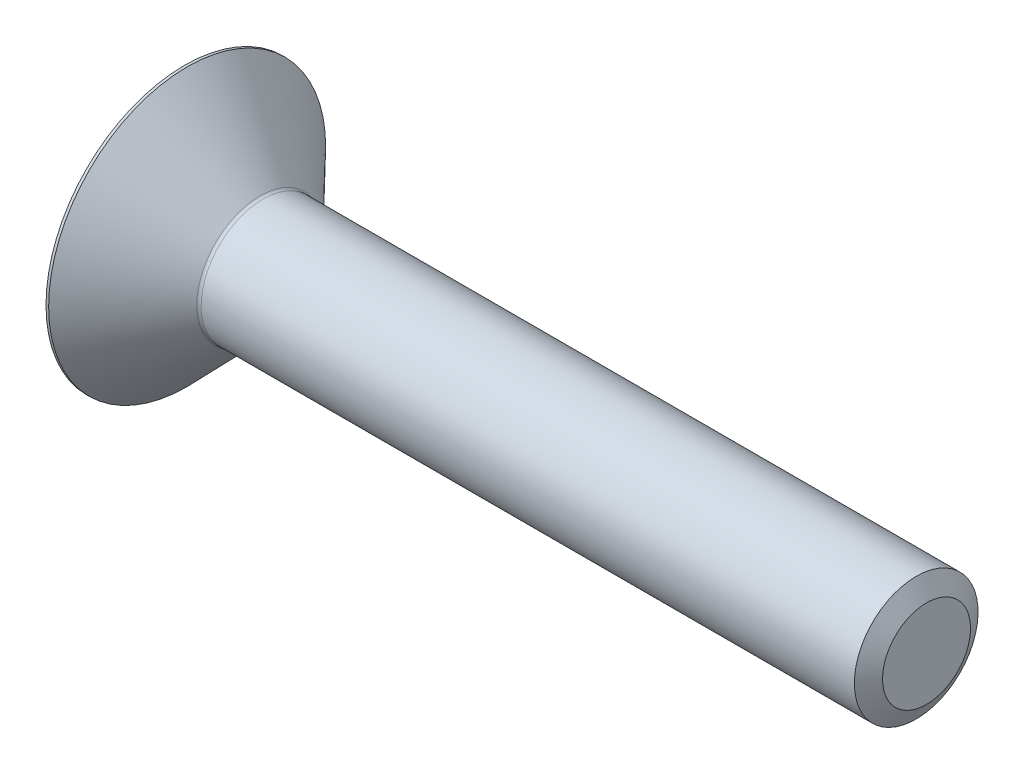
ISO-10303-21;
HEADER;
FILE_DESCRIPTION(('STEP AP214'),'2;1');
FILE_NAME('part.step','',(''),(''),'','','');
FILE_SCHEMA(('AUTOMOTIVE_DESIGN { 1 0 10303 214 1 1 1 1 }'));
ENDSEC;
DATA;
#1=APPLICATION_CONTEXT('core data for automotive mechanical design processes');
#2=APPLICATION_PROTOCOL_DEFINITION('international standard','automotive_design',2000,#1);
#3=PRODUCT_CONTEXT('',#1,'mechanical');
#4=PRODUCT('Part','Part','',(#3));
#5=PRODUCT_RELATED_PRODUCT_CATEGORY('part','',(#4));
#6=PRODUCT_DEFINITION_FORMATION('','',#4);
#7=PRODUCT_DEFINITION_CONTEXT('part definition',#1,'design');
#8=PRODUCT_DEFINITION('design','',#6,#7);
#9=PRODUCT_DEFINITION_SHAPE('','',#8);
#10=(LENGTH_UNIT() NAMED_UNIT(*) SI_UNIT(.MILLI.,.METRE.));
#11=(NAMED_UNIT(*) PLANE_ANGLE_UNIT() SI_UNIT($,.RADIAN.));
#12=(NAMED_UNIT(*) SI_UNIT($,.STERADIAN.) SOLID_ANGLE_UNIT());
#13=UNCERTAINTY_MEASURE_WITH_UNIT(LENGTH_MEASURE(1.E-05),#10,'distance_accuracy_value','');
#14=(GEOMETRIC_REPRESENTATION_CONTEXT(3) GLOBAL_UNCERTAINTY_ASSIGNED_CONTEXT((#13)) GLOBAL_UNIT_ASSIGNED_CONTEXT((#10,
#11,#12)) REPRESENTATION_CONTEXT('',''));
#15=CARTESIAN_POINT('',(0.,0.,0.));
#16=DIRECTION('',(0.,0.,1.));
#17=DIRECTION('',(1.,0.,0.));
#18=AXIS2_PLACEMENT_3D('',#15,#16,#17);
#19=CARTESIAN_POINT('',(-16.9039999999541,0.,0.));
#20=DIRECTION('',(-1.,0.,0.));
#21=DIRECTION('',(0.,0.,1.));
#22=AXIS2_PLACEMENT_3D('',#19,#20,#21);
#23=CONICAL_SURFACE('',#22,1.1616287414995,1.04719755118452);
#24=CARTESIAN_POINT('',(-16.2333333332754,0.,1.13686837721616E-10));
#25=VERTEX_POINT('',#24);
#26=VERTEX_LOOP('',#25);
#27=FACE_BOUND('',#26,.T.);
#28=CARTESIAN_POINT('',(-16.9000000000161,-1.15470053837692,4.0339967123924E-12));
#29=CARTESIAN_POINT('',(-16.8853477725791,-1.12932949060539,0.0439439437855954));
#30=CARTESIAN_POINT('',(-16.8720223385656,-1.10373944031041,0.0882672110647425));
#31=CARTESIAN_POINT('',(-16.8487631937152,-1.05211626511723,0.17768117334735));
#32=CARTESIAN_POINT('',(-16.8388377101839,-1.0260822232737,0.22277345654672));
#33=CARTESIAN_POINT('',(-16.8233879794877,-0.974336766416638,0.312399216884018));
#34=CARTESIAN_POINT('',(-16.8177608938131,-0.948633310874631,0.356918907812861));
#35=CARTESIAN_POINT('',(-16.81104458408,-0.897105519638419,0.446167660235783));
#36=CARTESIAN_POINT('',(-16.809949797002,-0.871281371105214,0.490896397557499));
#37=CARTESIAN_POINT('',(-16.8122331450927,-0.823031719919259,0.574467244859048));
#38=CARTESIAN_POINT('',(-16.8150506426236,-0.800598977013268,0.613321895325356));
#39=CARTESIAN_POINT('',(-16.8239786503747,-0.755879633203904,0.690778070884315));
#40=CARTESIAN_POINT('',(-16.8300922074001,-0.733593186857356,0.729379328276695));
#41=CARTESIAN_POINT('',(-16.8453749166851,-0.688781716982386,0.806995070861984));
#42=CARTESIAN_POINT('',(-16.8546088211251,-0.66626236208915,0.845999737690744));
#43=CARTESIAN_POINT('',(-16.8755658804358,-0.621559431337452,0.923427484999919));
#44=CARTESIAN_POINT('',(-16.8872841143922,-0.599375283224557,0.961851556654085));
#45=CARTESIAN_POINT('',(-16.9000000000161,-0.577350269191957,0.999999999995966));
#46=B_SPLINE_CURVE_WITH_KNOTS('',3,(#28,#29,#30,#31,#32,#33,#34,#35,#36,#37,#38,#39,#40,#41,#42,
#43,#44,#45),.UNSPECIFIED.,.F.,.F.,(4,2,2,2,2,2,2,2,4),(0.,0.158508005778845,0.317396908514408,
0.472353803077548,0.627120444450221,0.761853891314731,0.89671209689346,1.0345608112381,
1.17213898674875),.UNSPECIFIED.);
#47=CARTESIAN_POINT('',(-16.9000000000161,-1.15470053837692,0.));
#48=VERTEX_POINT('',#47);
#49=CARTESIAN_POINT('',(-16.9000000000168,-0.577350269190795,0.999999999997983));
#50=VERTEX_POINT('',#49);
#51=EDGE_CURVE('E20',#48,#50,#46,.T.);
#52=ORIENTED_EDGE('',*,*,#51,.T.);
#53=CARTESIAN_POINT('',(-16.9000000000161,-0.57735026918497,1.));
#54=CARTESIAN_POINT('',(-16.8863168864524,-0.529955537080034,0.999999999999876));
#55=CARTESIAN_POINT('',(-16.873789609974,-0.482185870569069,0.999999999999938));
#56=CARTESIAN_POINT('',(-16.8516492031741,-0.385870552392807,1.00000000000006));
#57=CARTESIAN_POINT('',(-16.8420425930767,-0.337323415542599,1.00000000000012));
#58=CARTESIAN_POINT('',(-16.8265940010239,-0.240773884149867,0.999999999999879));
#59=CARTESIAN_POINT('',(-16.8206696536425,-0.192785083011085,0.99999999999958));
#60=CARTESIAN_POINT('',(-16.8127165686723,-0.0965306160788095,1.00000000000042));
#61=CARTESIAN_POINT('',(-16.810683602537,-0.0482653080392742,1.00000000000156));
#62=CARTESIAN_POINT('',(-16.8106836025371,0.0482653080397529,1.00000000000156));
#63=CARTESIAN_POINT('',(-16.8127165686723,0.0965306160792449,1.00000000000042));
#64=CARTESIAN_POINT('',(-16.8206696536426,0.192785083011433,0.99999999999958));
#65=CARTESIAN_POINT('',(-16.8265940010239,0.240773884150171,0.999999999999879));
#66=CARTESIAN_POINT('',(-16.8420425930768,0.337323415542815,1.00000000000012));
#67=CARTESIAN_POINT('',(-16.8516492031742,0.385870552392978,1.00000000000006));
#68=CARTESIAN_POINT('',(-16.873789609974,0.482185870569151,0.999999999999938));
#69=CARTESIAN_POINT('',(-16.8863168864524,0.529955537080074,0.999999999999876));
#70=CARTESIAN_POINT('',(-16.9000000000161,0.577350269184966,1.));
#71=B_SPLINE_CURVE_WITH_KNOTS('',3,(#53,#54,#55,#56,#57,#58,#59,#60,#61,#62,#63,#64,#65,#66,#67,
#68,#69,#70),.UNSPECIFIED.,.F.,.F.,(4,2,2,2,2,2,2,2,4),(0.,0.148036697957628,0.296401493042135,
0.441315429581836,0.586071806658116,0.730828183734268,0.875742120273841,1.02410691535821,
1.17214361331571),.UNSPECIFIED.);
#72=CARTESIAN_POINT('',(-16.9000000000161,0.57735026918846,0.999999999997983));
#73=VERTEX_POINT('',#72);
#74=EDGE_CURVE('E81',#50,#73,#71,.T.);
#75=ORIENTED_EDGE('',*,*,#74,.T.);
#76=CARTESIAN_POINT('',(-16.9000000000161,0.577350269191953,0.999999999995966));
#77=CARTESIAN_POINT('',(-16.8853477725791,0.602721316963491,0.956056056214405));
#78=CARTESIAN_POINT('',(-16.8720223385656,0.62831136725847,0.911732788935258));
#79=CARTESIAN_POINT('',(-16.8487631937152,0.679934542451645,0.82231882665265));
#80=CARTESIAN_POINT('',(-16.8388377101839,0.705968584295175,0.777226543453281));
#81=CARTESIAN_POINT('',(-16.8233879794877,0.757714041152239,0.687600783115984));
#82=CARTESIAN_POINT('',(-16.8177608938131,0.783417496694246,0.64308109218714));
#83=CARTESIAN_POINT('',(-16.81104458408,0.834945287930458,0.553832339764219));
#84=CARTESIAN_POINT('',(-16.809949797002,0.860769436463662,0.509103602442503));
#85=CARTESIAN_POINT('',(-16.8122331450927,0.909019087649617,0.425532755140954));
#86=CARTESIAN_POINT('',(-16.8150506426236,0.931451830555608,0.386678104674646));
#87=CARTESIAN_POINT('',(-16.8239786503747,0.976171174364972,0.309221929115687));
#88=CARTESIAN_POINT('',(-16.8300922074001,0.998457620711521,0.270620671723307));
#89=CARTESIAN_POINT('',(-16.8453749166851,1.04326909058649,0.193004929138017));
#90=CARTESIAN_POINT('',(-16.8546088211251,1.06578844547973,0.154000262309257));
#91=CARTESIAN_POINT('',(-16.8755658804358,1.11049137623143,0.0765725150000815));
#92=CARTESIAN_POINT('',(-16.8872841143922,1.13267552434432,0.0381484433459156));
#93=CARTESIAN_POINT('',(-16.9000000000161,1.15470053837692,4.03385526722819E-12));
#94=B_SPLINE_CURVE_WITH_KNOTS('',3,(#76,#77,#78,#79,#80,#81,#82,#83,#84,#85,#86,#87,#88,#89,#90,
#91,#92,#93),.UNSPECIFIED.,.F.,.F.,(4,2,2,2,2,2,2,2,4),(0.,0.158508005778844,0.317396908514406,
0.472353803077547,0.627120444450219,0.761853891314729,0.896712096893458,1.0345608112381,
1.17213898674875),.UNSPECIFIED.);
#95=CARTESIAN_POINT('',(-16.9000000000161,1.15470053837692,0.));
#96=VERTEX_POINT('',#95);
#97=EDGE_CURVE('E93',#73,#96,#94,.T.);
#98=ORIENTED_EDGE('',*,*,#97,.T.);
#99=CARTESIAN_POINT('',(-16.9000000000161,1.15470053837692,-4.03331058430735E-12));
#100=CARTESIAN_POINT('',(-16.8853477725791,1.12932949060538,-0.0439439437855945));
#101=CARTESIAN_POINT('',(-16.8720223385656,1.1037394403104,-0.0882672110647415));
#102=CARTESIAN_POINT('',(-16.8487631937152,1.05211626511723,-0.177681173347349));
#103=CARTESIAN_POINT('',(-16.8388377101839,1.0260822232737,-0.222773456546718));
#104=CARTESIAN_POINT('',(-16.8233879794877,0.974336766416635,-0.312399216884015));
#105=CARTESIAN_POINT('',(-16.8177608938131,0.948633310874628,-0.356918907812859));
#106=CARTESIAN_POINT('',(-16.81104458408,0.897105519638416,-0.446167660235781));
#107=CARTESIAN_POINT('',(-16.809949797002,0.871281371105211,-0.490896397557496));
#108=CARTESIAN_POINT('',(-16.8122331450927,0.823031719919257,-0.574467244859045));
#109=CARTESIAN_POINT('',(-16.8150506426236,0.800598977013266,-0.613321895325353));
#110=CARTESIAN_POINT('',(-16.8239786503747,0.755879633203902,-0.690778070884312));
#111=CARTESIAN_POINT('',(-16.8300922074001,0.733593186857353,-0.729379328276692));
#112=CARTESIAN_POINT('',(-16.8453749166851,0.688781716982383,-0.806995070861982));
#113=CARTESIAN_POINT('',(-16.8546088211251,0.666262362089147,-0.845999737690742));
#114=CARTESIAN_POINT('',(-16.8755658804358,0.621559431337448,-0.923427484999917));
#115=CARTESIAN_POINT('',(-16.8872841143922,0.599375283224554,-0.961851556654083));
#116=CARTESIAN_POINT('',(-16.9000000000161,0.577350269191954,-0.999999999995965));
#117=B_SPLINE_CURVE_WITH_KNOTS('',3,(#99,#100,#101,#102,#103,#104,#105,#106,#107,#108,#109,#110,
#111,#112,#113,#114,#115,#116),.UNSPECIFIED.,.F.,.F.,(4,2,2,2,2,2,2,2,4),(0.,0.158508005778844,
0.317396908514406,0.472353803077546,0.627120444450219,0.761853891314728,0.896712096893457,
1.03456081123809,1.17213898674875),.UNSPECIFIED.);
#118=CARTESIAN_POINT('',(-16.9000000000161,0.577350269188461,-0.999999999997983));
#119=VERTEX_POINT('',#118);
#120=EDGE_CURVE('E100',#96,#119,#117,.T.);
#121=ORIENTED_EDGE('',*,*,#120,.T.);
#122=CARTESIAN_POINT('',(-16.9000000000161,0.577350269184967,-1.));
#123=CARTESIAN_POINT('',(-16.8863168864524,0.529955537080106,-0.999999999999876));
#124=CARTESIAN_POINT('',(-16.873789609974,0.482185870569216,-0.999999999999938));
#125=CARTESIAN_POINT('',(-16.8516492031742,0.385870552393109,-1.00000000000006));
#126=CARTESIAN_POINT('',(-16.8420425930768,0.337323415542979,-1.00000000000012));
#127=CARTESIAN_POINT('',(-16.8265940010239,0.240773884150401,-0.999999999999879));
#128=CARTESIAN_POINT('',(-16.8206696536426,0.192785083011696,-0.99999999999958));
#129=CARTESIAN_POINT('',(-16.8127165686724,0.096530616079572,-1.00000000000042));
#130=CARTESIAN_POINT('',(-16.8106836025371,0.0482653080401124,-1.00000000000156));
#131=CARTESIAN_POINT('',(-16.810683602537,-0.0482653080389148,-1.00000000000156));
#132=CARTESIAN_POINT('',(-16.8127165686723,-0.0965306160784825,-1.00000000000042));
#133=CARTESIAN_POINT('',(-16.8206696536425,-0.192785083010823,-0.99999999999958));
#134=CARTESIAN_POINT('',(-16.8265940010238,-0.240773884149637,-0.999999999999879));
#135=CARTESIAN_POINT('',(-16.8420425930767,-0.337323415542435,-1.00000000000012));
#136=CARTESIAN_POINT('',(-16.8516492031741,-0.385870552392677,-1.00000000000006));
#137=CARTESIAN_POINT('',(-16.8737896099739,-0.482185870569004,-0.999999999999938));
#138=CARTESIAN_POINT('',(-16.8863168864524,-0.529955537080002,-0.999999999999876));
#139=CARTESIAN_POINT('',(-16.9000000000161,-0.577350269184969,-1.));
#140=B_SPLINE_CURVE_WITH_KNOTS('',3,(#122,#123,#124,#125,#126,#127,#128,#129,#130,#131,#132,
#133,#134,#135,#136,#137,#138,#139),.UNSPECIFIED.,.F.,.F.,(4,2,2,2,2,2,2,2,4),(0.,
0.148036697957395,0.296401493041668,0.441315429581145,0.586071806657201,0.730828183733577,
0.875742120273374,1.02410691535798,1.17214361331571),.UNSPECIFIED.);
#141=CARTESIAN_POINT('',(-16.9000000000161,-0.577350269188463,-0.999999999997983));
#142=VERTEX_POINT('',#141);
#143=EDGE_CURVE('E103',#119,#142,#140,.T.);
#144=ORIENTED_EDGE('',*,*,#143,.T.);
#145=CARTESIAN_POINT('',(-16.9000000000161,-0.577350269191957,-0.999999999995966));
#146=CARTESIAN_POINT('',(-16.8853477725791,-0.602721316963495,-0.956056056214404));
#147=CARTESIAN_POINT('',(-16.8720223385656,-0.628311367258474,-0.911732788935257));
#148=CARTESIAN_POINT('',(-16.8487631937152,-0.679934542451649,-0.82231882665265));
#149=CARTESIAN_POINT('',(-16.8388377101839,-0.70596858429518,-0.777226543453281));
#150=CARTESIAN_POINT('',(-16.8233879794877,-0.757714041152243,-0.687600783115983));
#151=CARTESIAN_POINT('',(-16.8177608938131,-0.78341749669425,-0.64308109218714));
#152=CARTESIAN_POINT('',(-16.81104458408,-0.834945287930462,-0.553832339764218));
#153=CARTESIAN_POINT('',(-16.809949797002,-0.860769436463667,-0.509103602442502));
#154=CARTESIAN_POINT('',(-16.8122331450927,-0.909019087649621,-0.425532755140953));
#155=CARTESIAN_POINT('',(-16.8150506426236,-0.931451830555613,-0.386678104674645));
#156=CARTESIAN_POINT('',(-16.8239786503747,-0.976171174364977,-0.309221929115686));
#157=CARTESIAN_POINT('',(-16.8300922074001,-0.998457620711525,-0.270620671723307));
#158=CARTESIAN_POINT('',(-16.8453749166851,-1.0432690905865,-0.193004929138016));
#159=CARTESIAN_POINT('',(-16.8546088211251,-1.06578844547973,-0.154000262309256));
#160=CARTESIAN_POINT('',(-16.8755658804358,-1.11049137623143,-0.0765725150000809));
#161=CARTESIAN_POINT('',(-16.8872841143922,-1.13267552434432,-0.0381484433459151));
#162=CARTESIAN_POINT('',(-16.9000000000161,-1.15470053837692,-4.0342541360767E-12));
#163=B_SPLINE_CURVE_WITH_KNOTS('',3,(#145,#146,#147,#148,#149,#150,#151,#152,#153,#154,#155,
#156,#157,#158,#159,#160,#161,#162),.UNSPECIFIED.,.F.,.F.,(4,2,2,2,2,2,2,2,4),(0.,
0.158508005778843,0.317396908514406,0.472353803077546,0.627120444450219,0.761853891314729,
0.896712096893458,1.03456081123809,1.17213898674875),.UNSPECIFIED.);
#164=EDGE_CURVE('E73',#142,#48,#163,.T.);
#165=ORIENTED_EDGE('',*,*,#164,.T.);
#166=EDGE_LOOP('',(#52,#75,#98,#121,#144,#165));
#167=FACE_BOUND('',#166,.T.);
#168=ADVANCED_FACE('F16',(#27,#167),#23,.F.);
#169=CARTESIAN_POINT('',(-16.04,-1.15470053837925,0.));
#170=DIRECTION('',(0.,-0.866025403784439,0.5));
#171=DIRECTION('',(0.,-0.5,-0.866025403784439));
#172=AXIS2_PLACEMENT_3D('',#169,#170,#171);
#173=PLANE('',#172);
#174=DIRECTION('',(1.,0.,0.));
#175=VECTOR('',#174,1.);
#176=CARTESIAN_POINT('',(-16.04,-0.577350269189633,1.));
#177=LINE('',#176,#175);
#178=CARTESIAN_POINT('',(-17.9999999999999,-0.577350269189771,1.00000000000002));
#179=VERTEX_POINT('',#178);
#180=EDGE_CURVE('E85',#179,#50,#177,.T.);
#181=ORIENTED_EDGE('',*,*,#180,.T.);
#182=ORIENTED_EDGE('',*,*,#51,.F.);
#183=DIRECTION('',(1.,0.,0.));
#184=VECTOR('',#183,1.);
#185=CARTESIAN_POINT('',(-16.04,-1.15470053837925,0.));
#186=LINE('',#185,#184);
#187=CARTESIAN_POINT('',(-17.9999999999999,-1.15470053837933,0.));
#188=VERTEX_POINT('',#187);
#189=EDGE_CURVE('E104',#48,#188,#186,.F.);
#190=ORIENTED_EDGE('',*,*,#189,.T.);
#191=CARTESIAN_POINT('',(-17.9999999999999,-1.15470053837928,0.));
#192=CARTESIAN_POINT('',(-17.9931485433512,-1.1307355483116,0.0415085804000621));
#193=CARTESIAN_POINT('',(-17.9869265071695,-1.106721247571,0.0831025693910098));
#194=CARTESIAN_POINT('',(-17.9759925259882,-1.05859621230057,0.166457575595438));
#195=CARTESIAN_POINT('',(-17.9712812836437,-1.03448543816468,0.208218661408625));
#196=CARTESIAN_POINT('',(-17.9636494177607,-0.986333519050269,0.291620231796733));
#197=CARTESIAN_POINT('',(-17.9607184564333,-0.962292794802696,0.333259987644283));
#198=CARTESIAN_POINT('',(-17.9567881534659,-0.914176509020636,0.416599839290315));
#199=CARTESIAN_POINT('',(-17.9557883832487,-0.890100956402539,0.458299919645156));
#200=CARTESIAN_POINT('',(-17.9557883832487,-0.841949851166346,0.541700080354839));
#201=CARTESIAN_POINT('',(-17.9567881534659,-0.817874298548249,0.58340016070968));
#202=CARTESIAN_POINT('',(-17.9607184564333,-0.769758012766189,0.666740012355712));
#203=CARTESIAN_POINT('',(-17.9636494177607,-0.745717288518616,0.708379768203262));
#204=CARTESIAN_POINT('',(-17.9712812836437,-0.697565369404204,0.79178133859137));
#205=CARTESIAN_POINT('',(-17.9759925259882,-0.673454595268309,0.833542424404557));
#206=CARTESIAN_POINT('',(-17.9869265071695,-0.62532955999788,0.916897430608986));
#207=CARTESIAN_POINT('',(-17.9931485433512,-0.601315259257286,0.958491419599933));
#208=CARTESIAN_POINT('',(-17.9999999999999,-0.577350269189609,1.00000000000003));
#209=B_SPLINE_CURVE_WITH_KNOTS('',3,(#191,#192,#193,#194,#195,#196,#197,#198,#199,#200,#201,
#202,#203,#204,#205,#206,#207,#208),.UNSPECIFIED.,.F.,.F.,(4,2,2,2,2,2,2,2,4),(0.,
0.145260358344985,0.290588178163771,0.435063828864236,0.579507413305438,0.72395099774664,
0.868426648447105,1.01375446826589,1.15901482661088),.UNSPECIFIED.);
#210=EDGE_CURVE('E87',#188,#179,#209,.T.);
#211=ORIENTED_EDGE('',*,*,#210,.T.);
#212=EDGE_LOOP('',(#181,#182,#190,#211));
#213=FACE_BOUND('',#212,.T.);
#214=ADVANCED_FACE('F78',(#213),#173,.F.);
#215=CARTESIAN_POINT('',(-16.04,-0.577350269189628,-1.));
#216=DIRECTION('',(0.,-0.866025403784439,-0.5));
#217=DIRECTION('',(0.,0.5,-0.866025403784439));
#218=AXIS2_PLACEMENT_3D('',#215,#216,#217);
#219=PLANE('',#218);
#220=ORIENTED_EDGE('',*,*,#189,.F.);
#221=ORIENTED_EDGE('',*,*,#164,.F.);
#222=DIRECTION('',(-1.,0.,0.));
#223=VECTOR('',#222,1.);
#224=CARTESIAN_POINT('',(-16.04,-0.577350269189628,-1.));
#225=LINE('',#224,#223);
#226=CARTESIAN_POINT('',(-17.9999999999999,-0.577350269189669,-1.00000000000006));
#227=VERTEX_POINT('',#226);
#228=EDGE_CURVE('E101',#142,#227,#225,.T.);
#229=ORIENTED_EDGE('',*,*,#228,.T.);
#230=CARTESIAN_POINT('',(-17.9999999999999,-0.577350269189609,-1.00000000000003));
#231=CARTESIAN_POINT('',(-17.9931485433512,-0.601315259257285,-0.958491419599933));
#232=CARTESIAN_POINT('',(-17.9869265071695,-0.625329559997879,-0.916897430608986));
#233=CARTESIAN_POINT('',(-17.9759925259882,-0.673454595268309,-0.833542424404558));
#234=CARTESIAN_POINT('',(-17.9712812836437,-0.697565369404204,-0.791781338591371));
#235=CARTESIAN_POINT('',(-17.9636494177607,-0.745717288518615,-0.708379768203263));
#236=CARTESIAN_POINT('',(-17.9607184564333,-0.769758012766189,-0.666740012355713));
#237=CARTESIAN_POINT('',(-17.9567881534659,-0.817874298548249,-0.583400160709681));
#238=CARTESIAN_POINT('',(-17.9557883832487,-0.841949851166345,-0.54170008035484));
#239=CARTESIAN_POINT('',(-17.9557883832487,-0.890100956402539,-0.458299919645157));
#240=CARTESIAN_POINT('',(-17.9567881534659,-0.914176509020636,-0.416599839290315));
#241=CARTESIAN_POINT('',(-17.9607184564333,-0.962292794802696,-0.333259987644283));
#242=CARTESIAN_POINT('',(-17.9636494177607,-0.986333519050269,-0.291620231796734));
#243=CARTESIAN_POINT('',(-17.9712812836437,-1.03448543816468,-0.208218661408626));
#244=CARTESIAN_POINT('',(-17.9759925259882,-1.05859621230057,-0.166457575595439));
#245=CARTESIAN_POINT('',(-17.9869265071695,-1.106721247571,-0.0831025693910105));
#246=CARTESIAN_POINT('',(-17.9931485433512,-1.1307355483116,-0.0415085804000627));
#247=CARTESIAN_POINT('',(-17.9999999999999,-1.15470053837928,0.));
#248=B_SPLINE_CURVE_WITH_KNOTS('',3,(#230,#231,#232,#233,#234,#235,#236,#237,#238,#239,#240,
#241,#242,#243,#244,#245,#246,#247),.UNSPECIFIED.,.F.,.F.,(4,2,2,2,2,2,2,2,4),(0.,
0.145260358344985,0.290588178163772,0.435063828864236,0.579507413305438,0.723950997746641,
0.868426648447105,1.01375446826589,1.15901482661088),.UNSPECIFIED.);
#249=EDGE_CURVE('E213',#227,#188,#248,.T.);
#250=ORIENTED_EDGE('',*,*,#249,.T.);
#251=EDGE_LOOP('',(#220,#221,#229,#250));
#252=FACE_BOUND('',#251,.T.);
#253=ADVANCED_FACE('F207',(#252),#219,.F.);
#254=CARTESIAN_POINT('',(-16.04,0.577350269189624,-1.));
#255=DIRECTION('',(0.,0.,-1.));
#256=DIRECTION('',(-1.,0.,0.));
#257=AXIS2_PLACEMENT_3D('',#254,#255,#256);
#258=PLANE('',#257);
#259=ORIENTED_EDGE('',*,*,#228,.F.);
#260=ORIENTED_EDGE('',*,*,#143,.F.);
#261=DIRECTION('',(1.,0.,0.));
#262=VECTOR('',#261,1.);
#263=CARTESIAN_POINT('',(-16.04,0.577350269189625,-0.999999999999998));
#264=LINE('',#263,#262);
#265=CARTESIAN_POINT('',(-17.9999999999999,0.577350269189663,-1.00000000000007));
#266=VERTEX_POINT('',#265);
#267=EDGE_CURVE('E98',#119,#266,#264,.F.);
#268=ORIENTED_EDGE('',*,*,#267,.T.);
#269=CARTESIAN_POINT('',(-17.9999999999999,0.577350269189668,-1.));
#270=CARTESIAN_POINT('',(-17.9931485433512,0.529420289054314,-1.));
#271=CARTESIAN_POINT('',(-17.9869265071695,0.481391687573126,-1.));
#272=CARTESIAN_POINT('',(-17.9759925259882,0.385141617032266,-1.));
#273=CARTESIAN_POINT('',(-17.9712812836437,0.336920068760476,-1.));
#274=CARTESIAN_POINT('',(-17.9636494177607,0.240616230531651,-1.));
#275=CARTESIAN_POINT('',(-17.9607184564333,0.192534782036505,-1.));
#276=CARTESIAN_POINT('',(-17.9567881534659,0.0963022104723835,-1.));
#277=CARTESIAN_POINT('',(-17.9557883832487,0.0481511052361896,-1.));
#278=CARTESIAN_POINT('',(-17.9557883832487,-0.0481511052361983,-1.));
#279=CARTESIAN_POINT('',(-17.9567881534659,-0.0963022104723922,-1.));
#280=CARTESIAN_POINT('',(-17.9607184564333,-0.192534782036513,-1.));
#281=CARTESIAN_POINT('',(-17.9636494177607,-0.24061623053166,-1.));
#282=CARTESIAN_POINT('',(-17.9712812836437,-0.336920068760484,-1.));
#283=CARTESIAN_POINT('',(-17.9759925259882,-0.385141617032274,-1.));
#284=CARTESIAN_POINT('',(-17.9869265071695,-0.481391687573134,-1.));
#285=CARTESIAN_POINT('',(-17.9931485433512,-0.529420289054323,-1.));
#286=CARTESIAN_POINT('',(-17.9999999999999,-0.577350269189676,-1.));
#287=B_SPLINE_CURVE_WITH_KNOTS('',3,(#269,#270,#271,#272,#273,#274,#275,#276,#277,#278,#279,
#280,#281,#282,#283,#284,#285,#286),.UNSPECIFIED.,.F.,.F.,(4,2,2,2,2,2,2,2,4),(0.,
0.145260358344988,0.290588178163777,0.435063828864243,0.579507413305447,0.723950997746651,
0.868426648447117,1.01375446826591,1.15901482661089),.UNSPECIFIED.);
#288=EDGE_CURVE('E175',#266,#227,#287,.T.);
#289=ORIENTED_EDGE('',*,*,#288,.T.);
#290=EDGE_LOOP('',(#259,#260,#268,#289));
#291=FACE_BOUND('',#290,.T.);
#292=ADVANCED_FACE('F185',(#291),#258,.F.);
#293=CARTESIAN_POINT('',(-16.04,1.15470053837925,0.));
#294=DIRECTION('',(0.,0.866025403784439,-0.5));
#295=DIRECTION('',(0.,0.5,0.866025403784439));
#296=AXIS2_PLACEMENT_3D('',#293,#294,#295);
#297=PLANE('',#296);
#298=ORIENTED_EDGE('',*,*,#267,.F.);
#299=ORIENTED_EDGE('',*,*,#120,.F.);
#300=DIRECTION('',(1.,0.,0.));
#301=VECTOR('',#300,1.);
#302=CARTESIAN_POINT('',(-16.04,1.15470053837925,0.));
#303=LINE('',#302,#301);
#304=CARTESIAN_POINT('',(-17.9999999999999,1.15470053837933,0.));
#305=VERTEX_POINT('',#304);
#306=EDGE_CURVE('E89',#96,#305,#303,.F.);
#307=ORIENTED_EDGE('',*,*,#306,.T.);
#308=CARTESIAN_POINT('',(-17.9999999999999,1.15470053837927,0.));
#309=CARTESIAN_POINT('',(-17.9931485433512,1.13073554831159,-0.0415085804000635));
#310=CARTESIAN_POINT('',(-17.9869265071695,1.106721247571,-0.0831025693910112));
#311=CARTESIAN_POINT('',(-17.9759925259882,1.05859621230057,-0.16645757559544));
#312=CARTESIAN_POINT('',(-17.9712812836437,1.03448543816467,-0.208218661408627));
#313=CARTESIAN_POINT('',(-17.9636494177607,0.986333519050263,-0.291620231796735));
#314=CARTESIAN_POINT('',(-17.9607184564333,0.96229279480269,-0.333259987644286));
#315=CARTESIAN_POINT('',(-17.9567881534659,0.91417650902063,-0.416599839290318));
#316=CARTESIAN_POINT('',(-17.9557883832487,0.890100956402533,-0.45829991964516));
#317=CARTESIAN_POINT('',(-17.9557883832487,0.841949851166339,-0.541700080354843));
#318=CARTESIAN_POINT('',(-17.9567881534659,0.817874298548242,-0.583400160709684));
#319=CARTESIAN_POINT('',(-17.9607184564333,0.769758012766182,-0.666740012355717));
#320=CARTESIAN_POINT('',(-17.9636494177607,0.745717288518609,-0.708379768203267));
#321=CARTESIAN_POINT('',(-17.9712812836437,0.697565369404197,-0.791781338591375));
#322=CARTESIAN_POINT('',(-17.9759925259882,0.673454595268302,-0.833542424404562));
#323=CARTESIAN_POINT('',(-17.9869265071695,0.625329559997873,-0.916897430608991));
#324=CARTESIAN_POINT('',(-17.9931485433512,0.601315259257279,-0.958491419599939));
#325=CARTESIAN_POINT('',(-17.9999999999999,0.577350269189602,-1.00000000000004));
#326=B_SPLINE_CURVE_WITH_KNOTS('',3,(#308,#309,#310,#311,#312,#313,#314,#315,#316,#317,#318,
#319,#320,#321,#322,#323,#324,#325),.UNSPECIFIED.,.F.,.F.,(4,2,2,2,2,2,2,2,4),(0.,
0.145260358344986,0.290588178163773,0.435063828864238,0.579507413305441,0.723950997746644,
0.868426648447109,1.0137544682659,1.15901482661088),.UNSPECIFIED.);
#327=EDGE_CURVE('E168',#305,#266,#326,.T.);
#328=ORIENTED_EDGE('',*,*,#327,.T.);
#329=EDGE_LOOP('',(#298,#299,#307,#328));
#330=FACE_BOUND('',#329,.T.);
#331=ADVANCED_FACE('F181',(#330),#297,.F.);
#332=CARTESIAN_POINT('',(-16.04,0.577350269189624,1.));
#333=DIRECTION('',(0.,0.866025403784439,0.5));
#334=DIRECTION('',(0.,-0.5,0.866025403784439));
#335=AXIS2_PLACEMENT_3D('',#332,#333,#334);
#336=PLANE('',#335);
#337=ORIENTED_EDGE('',*,*,#306,.F.);
#338=ORIENTED_EDGE('',*,*,#97,.F.);
#339=DIRECTION('',(1.,0.,0.));
#340=VECTOR('',#339,1.);
#341=CARTESIAN_POINT('',(-16.04,0.577350269189624,1.));
#342=LINE('',#341,#340);
#343=CARTESIAN_POINT('',(-17.9999999999999,0.577350269189664,1.00000000000007));
#344=VERTEX_POINT('',#343);
#345=EDGE_CURVE('E91',#73,#344,#342,.F.);
#346=ORIENTED_EDGE('',*,*,#345,.T.);
#347=CARTESIAN_POINT('',(-17.9999999999999,0.577350269189603,1.00000000000004));
#348=CARTESIAN_POINT('',(-17.9931485433512,0.60131525925728,0.958491419599935));
#349=CARTESIAN_POINT('',(-17.9869265071695,0.625329559997874,0.916897430608987));
#350=CARTESIAN_POINT('',(-17.9759925259882,0.673454595268304,0.833542424404559));
#351=CARTESIAN_POINT('',(-17.9712812836437,0.697565369404199,0.791781338591371));
#352=CARTESIAN_POINT('',(-17.9636494177607,0.745717288518611,0.708379768203263));
#353=CARTESIAN_POINT('',(-17.9607184564333,0.769758012766184,0.666740012355713));
#354=CARTESIAN_POINT('',(-17.9567881534659,0.817874298548245,0.58340016070968));
#355=CARTESIAN_POINT('',(-17.9557883832487,0.841949851166342,0.541700080354838));
#356=CARTESIAN_POINT('',(-17.9557883832487,0.890100956402535,0.458299919645155));
#357=CARTESIAN_POINT('',(-17.9567881534659,0.914176509020632,0.416599839290313));
#358=CARTESIAN_POINT('',(-17.9607184564333,0.962292794802693,0.333259987644281));
#359=CARTESIAN_POINT('',(-17.9636494177607,0.986333519050266,0.291620231796731));
#360=CARTESIAN_POINT('',(-17.9712812836437,1.03448543816468,0.208218661408623));
#361=CARTESIAN_POINT('',(-17.9759925259882,1.05859621230057,0.166457575595435));
#362=CARTESIAN_POINT('',(-17.9869265071695,1.106721247571,0.0831025693910063));
#363=CARTESIAN_POINT('',(-17.9931485433512,1.1307355483116,0.0415085804000584));
#364=CARTESIAN_POINT('',(-17.9999999999999,1.15470053837927,0.));
#365=B_SPLINE_CURVE_WITH_KNOTS('',3,(#347,#348,#349,#350,#351,#352,#353,#354,#355,#356,#357,
#358,#359,#360,#361,#362,#363,#364),.UNSPECIFIED.,.F.,.F.,(4,2,2,2,2,2,2,2,4),(0.,
0.145260358344986,0.290588178163773,0.435063828864239,0.579507413305442,0.723950997746646,
0.868426648447111,1.0137544682659,1.15901482661088),.UNSPECIFIED.);
#366=EDGE_CURVE('E138',#344,#305,#365,.T.);
#367=ORIENTED_EDGE('',*,*,#366,.T.);
#368=EDGE_LOOP('',(#337,#338,#346,#367));
#369=FACE_BOUND('',#368,.T.);
#370=ADVANCED_FACE('F184',(#369),#336,.F.);
#371=CARTESIAN_POINT('',(-16.04,-0.577350269189628,1.));
#372=DIRECTION('',(0.,0.,1.));
#373=DIRECTION('',(1.,0.,0.));
#374=AXIS2_PLACEMENT_3D('',#371,#372,#373);
#375=PLANE('',#374);
#376=ORIENTED_EDGE('',*,*,#345,.F.);
#377=ORIENTED_EDGE('',*,*,#74,.F.);
#378=ORIENTED_EDGE('',*,*,#180,.F.);
#379=CARTESIAN_POINT('',(-17.9999999999999,-0.577350269189677,1.));
#380=CARTESIAN_POINT('',(-17.9931485433512,-0.529420289054324,1.));
#381=CARTESIAN_POINT('',(-17.9869265071695,-0.481391687573136,1.));
#382=CARTESIAN_POINT('',(-17.9759925259882,-0.385141617032275,1.));
#383=CARTESIAN_POINT('',(-17.9712812836437,-0.336920068760484,1.));
#384=CARTESIAN_POINT('',(-17.9636494177607,-0.240616230531659,1.));
#385=CARTESIAN_POINT('',(-17.9607184564333,-0.192534782036513,1.));
#386=CARTESIAN_POINT('',(-17.9567881534659,-0.0963022104723928,1.));
#387=CARTESIAN_POINT('',(-17.9557883832487,-0.0481511052362001,1.));
#388=CARTESIAN_POINT('',(-17.9557883832487,0.0481511052361859,1.));
#389=CARTESIAN_POINT('',(-17.9567881534659,0.0963022104723793,1.));
#390=CARTESIAN_POINT('',(-17.9607184564333,0.192534782036501,1.));
#391=CARTESIAN_POINT('',(-17.9636494177607,0.240616230531648,1.));
#392=CARTESIAN_POINT('',(-17.9712812836437,0.336920068760475,1.));
#393=CARTESIAN_POINT('',(-17.9759925259882,0.385141617032266,1.));
#394=CARTESIAN_POINT('',(-17.9869265071695,0.481391687573128,1.));
#395=CARTESIAN_POINT('',(-17.9931485433512,0.529420289054317,1.));
#396=CARTESIAN_POINT('',(-17.9999999999999,0.577350269189671,1.));
#397=B_SPLINE_CURVE_WITH_KNOTS('',3,(#379,#380,#381,#382,#383,#384,#385,#386,#387,#388,#389,
#390,#391,#392,#393,#394,#395,#396),.UNSPECIFIED.,.F.,.F.,(4,2,2,2,2,2,2,2,4),(0.,
0.145260358344985,0.290588178163776,0.435063828864241,0.579507413305442,0.723950997746646,
0.868426648447113,1.01375446826591,1.15901482661089),.UNSPECIFIED.);
#398=EDGE_CURVE('E38',#179,#344,#397,.T.);
#399=ORIENTED_EDGE('',*,*,#398,.T.);
#400=EDGE_LOOP('',(#376,#377,#378,#399));
#401=FACE_BOUND('',#400,.T.);
#402=ADVANCED_FACE('F145',(#401),#375,.F.);
#403=CARTESIAN_POINT('',(-17.9999999999997,0.,0.));
#404=DIRECTION('',(-1.,0.,0.));
#405=DIRECTION('',(0.,0.,1.));
#406=AXIS2_PLACEMENT_3D('',#403,#404,#405);
#407=CONICAL_SURFACE('',#406,1.15470053837852,1.2924281638628);
#408=CARTESIAN_POINT('',(-17.9999999999999,0.,0.));
#409=DIRECTION('',(-1.,0.,0.));
#410=DIRECTION('',(0.,0.,1.));
#411=AXIS2_PLACEMENT_3D('',#408,#409,#410);
#412=CIRCLE('',#411,1.15470053837941);
#413=EDGE_CURVE('E129',#179,#188,#412,.F.);
#414=ORIENTED_EDGE('',*,*,#413,.F.);
#415=ORIENTED_EDGE('',*,*,#210,.F.);
#416=EDGE_LOOP('',(#414,#415));
#417=FACE_BOUND('',#416,.T.);
#418=ADVANCED_FACE('F225',(#417),#407,.F.);
#419=CARTESIAN_POINT('',(-17.9999999999997,0.,0.));
#420=DIRECTION('',(-1.,0.,0.));
#421=DIRECTION('',(0.,0.,1.));
#422=AXIS2_PLACEMENT_3D('',#419,#420,#421);
#423=CONICAL_SURFACE('',#422,1.15470053837852,1.2924281638628);
#424=CARTESIAN_POINT('',(-17.9999999999999,0.,0.));
#425=DIRECTION('',(-1.,0.,0.));
#426=DIRECTION('',(0.,0.,1.));
#427=AXIS2_PLACEMENT_3D('',#424,#425,#426);
#428=CIRCLE('',#427,1.15470053837941);
#429=EDGE_CURVE('E126',#188,#227,#428,.F.);
#430=ORIENTED_EDGE('',*,*,#429,.F.);
#431=ORIENTED_EDGE('',*,*,#249,.F.);
#432=EDGE_LOOP('',(#430,#431));
#433=FACE_BOUND('',#432,.T.);
#434=ADVANCED_FACE('F222',(#433),#423,.F.);
#435=CARTESIAN_POINT('',(-17.9999999999997,0.,0.));
#436=DIRECTION('',(-1.,0.,0.));
#437=DIRECTION('',(0.,0.,1.));
#438=AXIS2_PLACEMENT_3D('',#435,#436,#437);
#439=CONICAL_SURFACE('',#438,1.15470053837852,1.29242816386264);
#440=CARTESIAN_POINT('',(-17.9999999999999,0.,0.));
#441=DIRECTION('',(-1.,0.,0.));
#442=DIRECTION('',(0.,0.,1.));
#443=AXIS2_PLACEMENT_3D('',#440,#441,#442);
#444=CIRCLE('',#443,1.1547005383794);
#445=EDGE_CURVE('E123',#227,#266,#444,.F.);
#446=ORIENTED_EDGE('',*,*,#445,.F.);
#447=ORIENTED_EDGE('',*,*,#288,.F.);
#448=EDGE_LOOP('',(#446,#447));
#449=FACE_BOUND('',#448,.T.);
#450=ADVANCED_FACE('F164',(#449),#439,.F.);
#451=CARTESIAN_POINT('',(-17.9999999999997,0.,0.));
#452=DIRECTION('',(-1.,0.,0.));
#453=DIRECTION('',(0.,0.,1.));
#454=AXIS2_PLACEMENT_3D('',#451,#452,#453);
#455=CONICAL_SURFACE('',#454,1.15470053837852,1.2924281638628);
#456=CARTESIAN_POINT('',(-17.9999999999999,0.,0.));
#457=DIRECTION('',(-1.,0.,0.));
#458=DIRECTION('',(0.,0.,1.));
#459=AXIS2_PLACEMENT_3D('',#456,#457,#458);
#460=CIRCLE('',#459,1.1547005383794);
#461=EDGE_CURVE('E120',#266,#305,#460,.F.);
#462=ORIENTED_EDGE('',*,*,#461,.F.);
#463=ORIENTED_EDGE('',*,*,#327,.F.);
#464=EDGE_LOOP('',(#462,#463));
#465=FACE_BOUND('',#464,.T.);
#466=ADVANCED_FACE('F159',(#465),#455,.F.);
#467=CARTESIAN_POINT('',(-17.9999999999997,0.,0.));
#468=DIRECTION('',(-1.,0.,0.));
#469=DIRECTION('',(0.,0.,1.));
#470=AXIS2_PLACEMENT_3D('',#467,#468,#469);
#471=CONICAL_SURFACE('',#470,1.15470053837852,1.2924281638628);
#472=CARTESIAN_POINT('',(-17.9999999999999,0.,0.));
#473=DIRECTION('',(-1.,0.,0.));
#474=DIRECTION('',(0.,0.,1.));
#475=AXIS2_PLACEMENT_3D('',#472,#473,#474);
#476=CIRCLE('',#475,1.15470053837941);
#477=EDGE_CURVE('E117',#305,#344,#476,.F.);
#478=ORIENTED_EDGE('',*,*,#477,.F.);
#479=ORIENTED_EDGE('',*,*,#366,.F.);
#480=EDGE_LOOP('',(#478,#479));
#481=FACE_BOUND('',#480,.T.);
#482=ADVANCED_FACE('F153',(#481),#471,.F.);
#483=CARTESIAN_POINT('',(-17.9999999999997,0.,0.));
#484=DIRECTION('',(-1.,0.,0.));
#485=DIRECTION('',(0.,0.,1.));
#486=AXIS2_PLACEMENT_3D('',#483,#484,#485);
#487=CONICAL_SURFACE('',#486,1.15470053837852,1.29242816386288);
#488=ORIENTED_EDGE('',*,*,#398,.F.);
#489=CARTESIAN_POINT('',(-17.9999999999999,0.,0.));
#490=DIRECTION('',(-1.,0.,0.));
#491=DIRECTION('',(0.,0.,1.));
#492=AXIS2_PLACEMENT_3D('',#489,#490,#491);
#493=CIRCLE('',#492,1.15470053837941);
#494=EDGE_CURVE('E114',#344,#179,#493,.F.);
#495=ORIENTED_EDGE('',*,*,#494,.F.);
#496=EDGE_LOOP('',(#488,#495));
#497=FACE_BOUND('',#496,.T.);
#498=ADVANCED_FACE('F148',(#497),#487,.F.);
#499=CARTESIAN_POINT('',(-18.,3.36,0.));
#500=DIRECTION('',(-1.,0.,0.));
#501=DIRECTION('',(0.,-1.,0.));
#502=AXIS2_PLACEMENT_3D('',#499,#500,#501);
#503=PLANE('',#502);
#504=ORIENTED_EDGE('',*,*,#477,.T.);
#505=ORIENTED_EDGE('',*,*,#494,.T.);
#506=ORIENTED_EDGE('',*,*,#413,.T.);
#507=ORIENTED_EDGE('',*,*,#429,.T.);
#508=ORIENTED_EDGE('',*,*,#445,.T.);
#509=ORIENTED_EDGE('',*,*,#461,.T.);
#510=EDGE_LOOP('',(#504,#505,#506,#507,#508,#509));
#511=FACE_BOUND('',#510,.T.);
#512=CARTESIAN_POINT('',(-18.,0.,0.));
#513=DIRECTION('',(1.,0.,0.));
#514=DIRECTION('',(0.,1.,0.));
#515=AXIS2_PLACEMENT_3D('',#512,#513,#514);
#516=CIRCLE('',#515,3.36);
#517=CARTESIAN_POINT('',(-18.,3.36,0.));
#518=VERTEX_POINT('',#517);
#519=EDGE_CURVE('E110',#518,#518,#516,.T.);
#520=ORIENTED_EDGE('',*,*,#519,.F.);
#521=EDGE_LOOP('',(#520));
#522=FACE_BOUND('',#521,.T.);
#523=ADVANCED_FACE('F152',(#511,#522),#503,.T.);
#524=CARTESIAN_POINT('',(0.,0.,0.));
#525=DIRECTION('',(1.,0.,0.));
#526=DIRECTION('',(0.,1.,0.));
#527=AXIS2_PLACEMENT_3D('',#524,#525,#526);
#528=CYLINDRICAL_SURFACE('',#527,3.36);
#529=CARTESIAN_POINT('',(-17.9361811211152,0.,0.));
#530=DIRECTION('',(-1.,0.,0.));
#531=DIRECTION('',(0.,-1.,0.));
#532=AXIS2_PLACEMENT_3D('',#529,#530,#531);
#533=CIRCLE('',#532,3.35999999998648);
#534=CARTESIAN_POINT('',(-17.9361811211152,-3.35999999998648,0.));
#535=VERTEX_POINT('',#534);
#536=EDGE_CURVE('E113',#535,#535,#533,.F.);
#537=ORIENTED_EDGE('',*,*,#536,.F.);
#538=EDGE_LOOP('',(#537));
#539=FACE_BOUND('',#538,.T.);
#540=ORIENTED_EDGE('',*,*,#519,.T.);
#541=EDGE_LOOP('',(#540));
#542=FACE_BOUND('',#541,.T.);
#543=ADVANCED_FACE('F263',(#539,#542),#528,.T.);
#544=CARTESIAN_POINT('',(-17.9361811210583,0.,0.));
#545=DIRECTION('',(-1.,0.,0.));
#546=DIRECTION('',(0.,0.,1.));
#547=AXIS2_PLACEMENT_3D('',#544,#545,#546);
#548=CONICAL_SURFACE('',#547,3.35999999992964,0.802851455924837);
#549=ORIENTED_EDGE('',*,*,#536,.T.);
#550=EDGE_LOOP('',(#549));
#551=FACE_BOUND('',#550,.T.);
#552=CARTESIAN_POINT('',(-16.1694864984129,0.,0.));
#553=DIRECTION('',(1.,0.,0.));
#554=DIRECTION('',(0.,1.,0.));
#555=AXIS2_PLACEMENT_3D('',#552,#553,#554);
#556=CIRCLE('',#555,1.5305341629541);
#557=CARTESIAN_POINT('',(-16.1694864984129,1.5305341629541,0.));
#558=VERTEX_POINT('',#557);
#559=EDGE_CURVE('E109',#558,#558,#556,.F.);
#560=ORIENTED_EDGE('',*,*,#559,.T.);
#561=EDGE_LOOP('',(#560));
#562=FACE_BOUND('',#561,.T.);
#563=ADVANCED_FACE('F260',(#551,#562),#548,.T.);
#564=CARTESIAN_POINT('',(0.,0.,0.));
#565=DIRECTION('',(1.,0.,0.));
#566=DIRECTION('',(0.,1.,0.));
#567=AXIS2_PLACEMENT_3D('',#564,#565,#566);
#568=PLANE('',#567);
#569=CARTESIAN_POINT('',(5.6843418860808E-11,0.,0.));
#570=DIRECTION('',(-1.,0.,0.));
#571=DIRECTION('',(0.,0.,1.));
#572=AXIS2_PLACEMENT_3D('',#569,#570,#571);
#573=CIRCLE('',#572,1.06698729814525);
#574=CARTESIAN_POINT('',(5.6843418860808E-11,0.,1.06698729814525));
#575=VERTEX_POINT('',#574);
#576=EDGE_CURVE('E106',#575,#575,#573,.T.);
#577=ORIENTED_EDGE('',*,*,#576,.F.);
#578=EDGE_LOOP('',(#577));
#579=FACE_BOUND('',#578,.T.);
#580=ADVANCED_FACE('F250',(#579),#568,.T.);
#581=CARTESIAN_POINT('',(-16.097552518379,0.,0.));
#582=DIRECTION('',(1.,0.,0.));
#583=DIRECTION('',(0.,1.,0.));
#584=AXIS2_PLACEMENT_3D('',#581,#582,#583);
#585=TOROIDAL_SURFACE('',#584,1.6,0.0999999999999989);
#586=CARTESIAN_POINT('',(-16.097552518379,0.,0.));
#587=DIRECTION('',(1.,0.,0.));
#588=DIRECTION('',(0.,1.,0.));
#589=AXIS2_PLACEMENT_3D('',#586,#587,#588);
#590=CIRCLE('',#589,1.5);
#591=CARTESIAN_POINT('',(-16.097552518379,1.5,0.));
#592=VERTEX_POINT('',#591);
#593=EDGE_CURVE('E29',#592,#592,#590,.T.);
#594=ORIENTED_EDGE('',*,*,#593,.F.);
#595=EDGE_LOOP('',(#594));
#596=FACE_BOUND('',#595,.T.);
#597=ORIENTED_EDGE('',*,*,#559,.F.);
#598=EDGE_LOOP('',(#597));
#599=FACE_BOUND('',#598,.T.);
#600=ADVANCED_FACE('F242',(#596,#599),#585,.F.);
#601=CARTESIAN_POINT('',(-0.249999999937245,0.,0.));
#602=DIRECTION('',(-1.,0.,0.));
#603=DIRECTION('',(0.,0.,1.));
#604=AXIS2_PLACEMENT_3D('',#601,#602,#603);
#605=CONICAL_SURFACE('',#604,1.50000000002137,1.04719755119074);
#606=CARTESIAN_POINT('',(-0.25,0.,0.));
#607=DIRECTION('',(1.,0.,0.));
#608=DIRECTION('',(0.,1.,0.));
#609=AXIS2_PLACEMENT_3D('',#606,#607,#608);
#610=CIRCLE('',#609,1.5);
#611=CARTESIAN_POINT('',(-0.25,1.5,0.));
#612=VERTEX_POINT('',#611);
#613=EDGE_CURVE('E11',#612,#612,#610,.F.);
#614=ORIENTED_EDGE('',*,*,#613,.F.);
#615=EDGE_LOOP('',(#614));
#616=FACE_BOUND('',#615,.T.);
#617=ORIENTED_EDGE('',*,*,#576,.T.);
#618=EDGE_LOOP('',(#617));
#619=FACE_BOUND('',#618,.T.);
#620=ADVANCED_FACE('F236',(#616,#619),#605,.T.);
#621=CARTESIAN_POINT('',(0.,0.,0.));
#622=DIRECTION('',(1.,0.,0.));
#623=DIRECTION('',(0.,1.,0.));
#624=AXIS2_PLACEMENT_3D('',#621,#622,#623);
#625=CYLINDRICAL_SURFACE('',#624,1.5);
#626=ORIENTED_EDGE('',*,*,#613,.T.);
#627=EDGE_LOOP('',(#626));
#628=FACE_BOUND('',#627,.T.);
#629=ORIENTED_EDGE('',*,*,#593,.T.);
#630=EDGE_LOOP('',(#629));
#631=FACE_BOUND('',#630,.T.);
#632=ADVANCED_FACE('F234',(#628,#631),#625,.T.);
#633=CLOSED_SHELL('',(#168,#214,#253,#292,#331,#370,#402,#418,#434,#450,#466,#482,#498,#523,
#543,#563,#580,#600,#620,#632));
#634=MANIFOLD_SOLID_BREP('B1',#633);
#635=ADVANCED_BREP_SHAPE_REPRESENTATION('',(#18,#634),#14);
#636=SHAPE_DEFINITION_REPRESENTATION(#9,#635);
ENDSEC;
END-ISO-10303-21;
